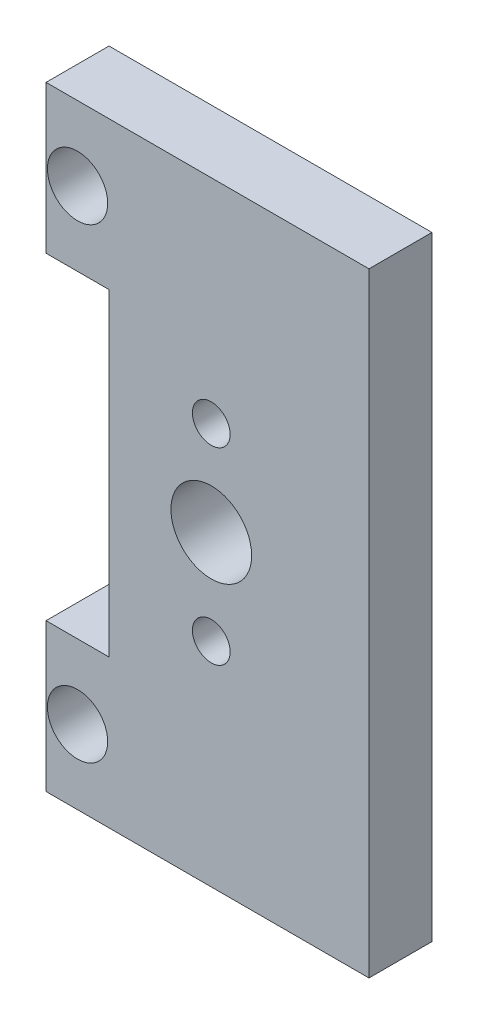
ISO-10303-21;
HEADER;
FILE_DESCRIPTION(('STEP AP214'),'2;1');
FILE_NAME('part.step','',(''),(''),'','','');
FILE_SCHEMA(('AUTOMOTIVE_DESIGN { 1 0 10303 214 1 1 1 1 }'));
ENDSEC;
DATA;
#1=APPLICATION_CONTEXT('core data for automotive mechanical design processes');
#2=APPLICATION_PROTOCOL_DEFINITION('international standard','automotive_design',2000,#1);
#3=PRODUCT_CONTEXT('',#1,'mechanical');
#4=PRODUCT('Part','Part','',(#3));
#5=PRODUCT_RELATED_PRODUCT_CATEGORY('part','',(#4));
#6=PRODUCT_DEFINITION_FORMATION('','',#4);
#7=PRODUCT_DEFINITION_CONTEXT('part definition',#1,'design');
#8=PRODUCT_DEFINITION('design','',#6,#7);
#9=PRODUCT_DEFINITION_SHAPE('','',#8);
#10=(LENGTH_UNIT() NAMED_UNIT(*) SI_UNIT(.MILLI.,.METRE.));
#11=(NAMED_UNIT(*) PLANE_ANGLE_UNIT() SI_UNIT($,.RADIAN.));
#12=(NAMED_UNIT(*) SI_UNIT($,.STERADIAN.) SOLID_ANGLE_UNIT());
#13=UNCERTAINTY_MEASURE_WITH_UNIT(LENGTH_MEASURE(1.E-05),#10,'distance_accuracy_value','');
#14=(GEOMETRIC_REPRESENTATION_CONTEXT(3) GLOBAL_UNCERTAINTY_ASSIGNED_CONTEXT((#13)) GLOBAL_UNIT_ASSIGNED_CONTEXT((#10,
#11,#12)) REPRESENTATION_CONTEXT('',''));
#15=CARTESIAN_POINT('',(0.,0.,0.));
#16=DIRECTION('',(0.,0.,1.));
#17=DIRECTION('',(1.,0.,0.));
#18=AXIS2_PLACEMENT_3D('',#15,#16,#17);
#19=CARTESIAN_POINT('',(0.,0.,2.9718));
#20=DIRECTION('',(0.,1.,0.));
#21=DIRECTION('',(0.,0.,1.));
#22=AXIS2_PLACEMENT_3D('',#19,#20,#21);
#23=PLANE('',#22);
#24=DIRECTION('',(1.,0.,0.));
#25=VECTOR('',#24,1.);
#26=CARTESIAN_POINT('',(0.,0.,0.));
#27=LINE('',#26,#25);
#28=CARTESIAN_POINT('',(0.,0.,0.));
#29=VERTEX_POINT('',#28);
#30=CARTESIAN_POINT('',(15.24,0.,0.));
#31=VERTEX_POINT('',#30);
#32=EDGE_CURVE('E152',#29,#31,#27,.T.);
#33=ORIENTED_EDGE('',*,*,#32,.T.);
#34=DIRECTION('',(0.,0.,-1.));
#35=VECTOR('',#34,1.);
#36=CARTESIAN_POINT('',(15.24,0.,2.9718));
#37=LINE('',#36,#35);
#38=CARTESIAN_POINT('',(15.24,0.,2.9718));
#39=VERTEX_POINT('',#38);
#40=EDGE_CURVE('E11',#39,#31,#37,.T.);
#41=ORIENTED_EDGE('',*,*,#40,.F.);
#42=DIRECTION('',(1.,0.,0.));
#43=VECTOR('',#42,1.);
#44=CARTESIAN_POINT('',(0.,0.,2.9718));
#45=LINE('',#44,#43);
#46=CARTESIAN_POINT('',(0.,0.,2.9718));
#47=VERTEX_POINT('',#46);
#48=EDGE_CURVE('E210',#47,#39,#45,.T.);
#49=ORIENTED_EDGE('',*,*,#48,.F.);
#50=DIRECTION('',(0.,0.,-1.));
#51=VECTOR('',#50,1.);
#52=CARTESIAN_POINT('',(0.,0.,2.9718));
#53=LINE('',#52,#51);
#54=EDGE_CURVE('E55',#47,#29,#53,.T.);
#55=ORIENTED_EDGE('',*,*,#54,.T.);
#56=EDGE_LOOP('',(#33,#41,#49,#55));
#57=FACE_BOUND('',#56,.T.);
#58=ADVANCED_FACE('F38',(#57),#23,.F.);
#59=CARTESIAN_POINT('',(15.24,0.,2.9718));
#60=DIRECTION('',(-1.,0.,0.));
#61=DIRECTION('',(0.,-1.,0.));
#62=AXIS2_PLACEMENT_3D('',#59,#60,#61);
#63=PLANE('',#62);
#64=DIRECTION('',(0.,1.,0.));
#65=VECTOR('',#64,1.);
#66=CARTESIAN_POINT('',(15.24,0.,0.));
#67=LINE('',#66,#65);
#68=CARTESIAN_POINT('',(15.24,28.985,0.));
#69=VERTEX_POINT('',#68);
#70=EDGE_CURVE('E154',#31,#69,#67,.T.);
#71=ORIENTED_EDGE('',*,*,#70,.T.);
#72=DIRECTION('',(0.,0.,-1.));
#73=VECTOR('',#72,1.);
#74=CARTESIAN_POINT('',(15.24,28.985,2.9718));
#75=LINE('',#74,#73);
#76=CARTESIAN_POINT('',(15.24,28.985,2.9718));
#77=VERTEX_POINT('',#76);
#78=EDGE_CURVE('E47',#77,#69,#75,.T.);
#79=ORIENTED_EDGE('',*,*,#78,.F.);
#80=DIRECTION('',(0.,1.,0.));
#81=VECTOR('',#80,1.);
#82=CARTESIAN_POINT('',(15.24,0.,2.9718));
#83=LINE('',#82,#81);
#84=EDGE_CURVE('E93',#39,#77,#83,.T.);
#85=ORIENTED_EDGE('',*,*,#84,.F.);
#86=ORIENTED_EDGE('',*,*,#40,.T.);
#87=EDGE_LOOP('',(#71,#79,#85,#86));
#88=FACE_BOUND('',#87,.T.);
#89=ADVANCED_FACE('F197',(#88),#63,.F.);
#90=CARTESIAN_POINT('',(0.,28.985,2.9718));
#91=DIRECTION('',(0.,1.,0.));
#92=DIRECTION('',(-1.,0.,0.));
#93=AXIS2_PLACEMENT_3D('',#90,#91,#92);
#94=PLANE('',#93);
#95=DIRECTION('',(1.,0.,0.));
#96=VECTOR('',#95,1.);
#97=CARTESIAN_POINT('',(0.,28.985,0.));
#98=LINE('',#97,#96);
#99=CARTESIAN_POINT('',(0.,28.985,0.));
#100=VERTEX_POINT('',#99);
#101=EDGE_CURVE('E157',#100,#69,#98,.T.);
#102=ORIENTED_EDGE('',*,*,#101,.F.);
#103=DIRECTION('',(0.,0.,-1.));
#104=VECTOR('',#103,1.);
#105=CARTESIAN_POINT('',(0.,28.985,2.9718));
#106=LINE('',#105,#104);
#107=CARTESIAN_POINT('',(0.,28.985,2.9718));
#108=VERTEX_POINT('',#107);
#109=EDGE_CURVE('E190',#108,#100,#106,.T.);
#110=ORIENTED_EDGE('',*,*,#109,.F.);
#111=DIRECTION('',(1.,0.,0.));
#112=VECTOR('',#111,1.);
#113=CARTESIAN_POINT('',(0.,28.985,2.9718));
#114=LINE('',#113,#112);
#115=EDGE_CURVE('E196',#108,#77,#114,.T.);
#116=ORIENTED_EDGE('',*,*,#115,.T.);
#117=ORIENTED_EDGE('',*,*,#78,.T.);
#118=EDGE_LOOP('',(#102,#110,#116,#117));
#119=FACE_BOUND('',#118,.T.);
#120=ADVANCED_FACE('F194',(#119),#94,.T.);
#121=CARTESIAN_POINT('',(0.,0.,2.9718));
#122=DIRECTION('',(-1.,0.,0.));
#123=DIRECTION('',(0.,0.,1.));
#124=AXIS2_PLACEMENT_3D('',#121,#122,#123);
#125=PLANE('',#124);
#126=DIRECTION('',(0.,1.,0.));
#127=VECTOR('',#126,1.);
#128=CARTESIAN_POINT('',(0.,0.,0.));
#129=LINE('',#128,#127);
#130=CARTESIAN_POINT('',(0.,22.,0.));
#131=VERTEX_POINT('',#130);
#132=EDGE_CURVE('E160',#131,#100,#129,.T.);
#133=ORIENTED_EDGE('',*,*,#132,.F.);
#134=DIRECTION('',(0.,0.,-1.));
#135=VECTOR('',#134,1.);
#136=CARTESIAN_POINT('',(0.,22.,2.9718));
#137=LINE('',#136,#135);
#138=CARTESIAN_POINT('',(0.,22.,2.9718));
#139=VERTEX_POINT('',#138);
#140=EDGE_CURVE('E188',#139,#131,#137,.T.);
#141=ORIENTED_EDGE('',*,*,#140,.F.);
#142=DIRECTION('',(0.,1.,0.));
#143=VECTOR('',#142,1.);
#144=CARTESIAN_POINT('',(0.,0.,2.9718));
#145=LINE('',#144,#143);
#146=EDGE_CURVE('E207',#139,#108,#145,.T.);
#147=ORIENTED_EDGE('',*,*,#146,.T.);
#148=ORIENTED_EDGE('',*,*,#109,.T.);
#149=EDGE_LOOP('',(#133,#141,#147,#148));
#150=FACE_BOUND('',#149,.T.);
#151=ADVANCED_FACE('F205',(#150),#125,.T.);
#152=CARTESIAN_POINT('',(0.,22.,2.9718));
#153=DIRECTION('',(0.,1.,0.));
#154=DIRECTION('',(0.,0.,1.));
#155=AXIS2_PLACEMENT_3D('',#152,#153,#154);
#156=PLANE('',#155);
#157=DIRECTION('',(1.,0.,0.));
#158=VECTOR('',#157,1.);
#159=CARTESIAN_POINT('',(0.,22.,0.));
#160=LINE('',#159,#158);
#161=CARTESIAN_POINT('',(2.9718,22.,0.));
#162=VERTEX_POINT('',#161);
#163=EDGE_CURVE('E163',#131,#162,#160,.T.);
#164=ORIENTED_EDGE('',*,*,#163,.T.);
#165=DIRECTION('',(0.,0.,-1.));
#166=VECTOR('',#165,1.);
#167=CARTESIAN_POINT('',(2.9718,22.,2.9718));
#168=LINE('',#167,#166);
#169=CARTESIAN_POINT('',(2.9718,22.,2.9718));
#170=VERTEX_POINT('',#169);
#171=EDGE_CURVE('E118',#170,#162,#168,.T.);
#172=ORIENTED_EDGE('',*,*,#171,.F.);
#173=DIRECTION('',(1.,0.,0.));
#174=VECTOR('',#173,1.);
#175=CARTESIAN_POINT('',(0.,22.,2.9718));
#176=LINE('',#175,#174);
#177=EDGE_CURVE('E128',#139,#170,#176,.T.);
#178=ORIENTED_EDGE('',*,*,#177,.F.);
#179=ORIENTED_EDGE('',*,*,#140,.T.);
#180=EDGE_LOOP('',(#164,#172,#178,#179));
#181=FACE_BOUND('',#180,.T.);
#182=ADVANCED_FACE('F240',(#181),#156,.F.);
#183=CARTESIAN_POINT('',(2.9718,0.,2.9718));
#184=DIRECTION('',(-1.,0.,0.));
#185=DIRECTION('',(0.,-1.,0.));
#186=AXIS2_PLACEMENT_3D('',#183,#184,#185);
#187=PLANE('',#186);
#188=DIRECTION('',(0.,1.,0.));
#189=VECTOR('',#188,1.);
#190=CARTESIAN_POINT('',(2.9718,0.,0.));
#191=LINE('',#190,#189);
#192=CARTESIAN_POINT('',(2.9718,6.985,0.));
#193=VERTEX_POINT('',#192);
#194=EDGE_CURVE('E114',#193,#162,#191,.T.);
#195=ORIENTED_EDGE('',*,*,#194,.F.);
#196=DIRECTION('',(0.,0.,-1.));
#197=VECTOR('',#196,1.);
#198=CARTESIAN_POINT('',(2.9718,6.985,2.9718));
#199=LINE('',#198,#197);
#200=CARTESIAN_POINT('',(2.9718,6.985,2.9718));
#201=VERTEX_POINT('',#200);
#202=EDGE_CURVE('E109',#201,#193,#199,.T.);
#203=ORIENTED_EDGE('',*,*,#202,.F.);
#204=DIRECTION('',(0.,1.,0.));
#205=VECTOR('',#204,1.);
#206=CARTESIAN_POINT('',(2.9718,0.,2.9718));
#207=LINE('',#206,#205);
#208=EDGE_CURVE('E112',#201,#170,#207,.T.);
#209=ORIENTED_EDGE('',*,*,#208,.T.);
#210=ORIENTED_EDGE('',*,*,#171,.T.);
#211=EDGE_LOOP('',(#195,#203,#209,#210));
#212=FACE_BOUND('',#211,.T.);
#213=ADVANCED_FACE('F111',(#212),#187,.T.);
#214=CARTESIAN_POINT('',(0.,6.985,2.9718));
#215=DIRECTION('',(0.,1.,0.));
#216=DIRECTION('',(0.,0.,1.));
#217=AXIS2_PLACEMENT_3D('',#214,#215,#216);
#218=PLANE('',#217);
#219=DIRECTION('',(1.,0.,0.));
#220=VECTOR('',#219,1.);
#221=CARTESIAN_POINT('',(0.,6.985,0.));
#222=LINE('',#221,#220);
#223=CARTESIAN_POINT('',(0.,6.985,0.));
#224=VERTEX_POINT('',#223);
#225=EDGE_CURVE('E167',#224,#193,#222,.T.);
#226=ORIENTED_EDGE('',*,*,#225,.F.);
#227=DIRECTION('',(0.,0.,-1.));
#228=VECTOR('',#227,1.);
#229=CARTESIAN_POINT('',(0.,6.985,2.9718));
#230=LINE('',#229,#228);
#231=CARTESIAN_POINT('',(0.,6.985,2.9718));
#232=VERTEX_POINT('',#231);
#233=EDGE_CURVE('E81',#232,#224,#230,.T.);
#234=ORIENTED_EDGE('',*,*,#233,.F.);
#235=DIRECTION('',(1.,0.,0.));
#236=VECTOR('',#235,1.);
#237=CARTESIAN_POINT('',(0.,6.985,2.9718));
#238=LINE('',#237,#236);
#239=EDGE_CURVE('E125',#232,#201,#238,.T.);
#240=ORIENTED_EDGE('',*,*,#239,.T.);
#241=ORIENTED_EDGE('',*,*,#202,.T.);
#242=EDGE_LOOP('',(#226,#234,#240,#241));
#243=FACE_BOUND('',#242,.T.);
#244=ADVANCED_FACE('F131',(#243),#218,.T.);
#245=CARTESIAN_POINT('',(7.7978,10.0475,2.9718));
#246=DIRECTION('',(0.,0.,-1.));
#247=DIRECTION('',(-1.,0.,0.));
#248=AXIS2_PLACEMENT_3D('',#245,#246,#247);
#249=CYLINDRICAL_SURFACE('',#248,0.889000000000003);
#250=CARTESIAN_POINT('',(7.7978,10.0475,2.9718));
#251=DIRECTION('',(0.,0.,1.));
#252=DIRECTION('',(1.,0.,0.));
#253=AXIS2_PLACEMENT_3D('',#250,#251,#252);
#254=CIRCLE('',#253,0.889000000000003);
#255=CARTESIAN_POINT('',(8.6868,10.0475,2.9718));
#256=VERTEX_POINT('',#255);
#257=EDGE_CURVE('E143',#256,#256,#254,.T.);
#258=ORIENTED_EDGE('',*,*,#257,.T.);
#259=EDGE_LOOP('',(#258));
#260=FACE_BOUND('',#259,.T.);
#261=CARTESIAN_POINT('',(7.7978,10.0475,0.));
#262=DIRECTION('',(0.,0.,1.));
#263=DIRECTION('',(1.,0.,0.));
#264=AXIS2_PLACEMENT_3D('',#261,#262,#263);
#265=CIRCLE('',#264,0.889000000000003);
#266=CARTESIAN_POINT('',(8.6868,10.0475,0.));
#267=VERTEX_POINT('',#266);
#268=EDGE_CURVE('E178',#267,#267,#265,.T.);
#269=ORIENTED_EDGE('',*,*,#268,.F.);
#270=EDGE_LOOP('',(#269));
#271=FACE_BOUND('',#270,.T.);
#272=ADVANCED_FACE('F248',(#260,#271),#249,.F.);
#273=CARTESIAN_POINT('',(7.7978,18.9375,2.9718));
#274=DIRECTION('',(0.,0.,-1.));
#275=DIRECTION('',(-1.,0.,0.));
#276=AXIS2_PLACEMENT_3D('',#273,#274,#275);
#277=CYLINDRICAL_SURFACE('',#276,0.889000000000003);
#278=CARTESIAN_POINT('',(7.7978,18.9375,2.9718));
#279=DIRECTION('',(0.,0.,1.));
#280=DIRECTION('',(1.,0.,0.));
#281=AXIS2_PLACEMENT_3D('',#278,#279,#280);
#282=CIRCLE('',#281,0.889000000000003);
#283=CARTESIAN_POINT('',(8.6868,18.9375,2.9718));
#284=VERTEX_POINT('',#283);
#285=EDGE_CURVE('E140',#284,#284,#282,.F.);
#286=ORIENTED_EDGE('',*,*,#285,.F.);
#287=EDGE_LOOP('',(#286));
#288=FACE_BOUND('',#287,.T.);
#289=CARTESIAN_POINT('',(7.7978,18.9375,0.));
#290=DIRECTION('',(0.,0.,1.));
#291=DIRECTION('',(1.,0.,0.));
#292=AXIS2_PLACEMENT_3D('',#289,#290,#291);
#293=CIRCLE('',#292,0.889000000000003);
#294=CARTESIAN_POINT('',(8.6868,18.9375,0.));
#295=VERTEX_POINT('',#294);
#296=EDGE_CURVE('E175',#295,#295,#293,.F.);
#297=ORIENTED_EDGE('',*,*,#296,.T.);
#298=EDGE_LOOP('',(#297));
#299=FACE_BOUND('',#298,.T.);
#300=ADVANCED_FACE('F255',(#288,#299),#277,.F.);
#301=CARTESIAN_POINT('',(1.4859,25.4925,2.9718));
#302=DIRECTION('',(0.,0.,-1.));
#303=DIRECTION('',(-1.,0.,0.));
#304=AXIS2_PLACEMENT_3D('',#301,#302,#303);
#305=CYLINDRICAL_SURFACE('',#304,1.4224);
#306=CARTESIAN_POINT('',(1.4859,25.4925,2.9718));
#307=DIRECTION('',(0.,0.,1.));
#308=DIRECTION('',(1.,0.,0.));
#309=AXIS2_PLACEMENT_3D('',#306,#307,#308);
#310=CIRCLE('',#309,1.4224);
#311=CARTESIAN_POINT('',(2.9083,25.4925,2.9718));
#312=VERTEX_POINT('',#311);
#313=EDGE_CURVE('E134',#312,#312,#310,.T.);
#314=ORIENTED_EDGE('',*,*,#313,.T.);
#315=EDGE_LOOP('',(#314));
#316=FACE_BOUND('',#315,.T.);
#317=CARTESIAN_POINT('',(1.4859,25.4925,0.));
#318=DIRECTION('',(0.,0.,1.));
#319=DIRECTION('',(1.,0.,0.));
#320=AXIS2_PLACEMENT_3D('',#317,#318,#319);
#321=CIRCLE('',#320,1.4224);
#322=CARTESIAN_POINT('',(2.9083,25.4925,0.));
#323=VERTEX_POINT('',#322);
#324=EDGE_CURVE('E172',#323,#323,#321,.T.);
#325=ORIENTED_EDGE('',*,*,#324,.F.);
#326=EDGE_LOOP('',(#325));
#327=FACE_BOUND('',#326,.T.);
#328=ADVANCED_FACE('F252',(#316,#327),#305,.F.);
#329=CARTESIAN_POINT('',(0.,0.,2.9718));
#330=DIRECTION('',(-1.,0.,0.));
#331=DIRECTION('',(0.,0.,1.));
#332=AXIS2_PLACEMENT_3D('',#329,#330,#331);
#333=PLANE('',#332);
#334=DIRECTION('',(0.,1.,0.));
#335=VECTOR('',#334,1.);
#336=CARTESIAN_POINT('',(0.,0.,0.));
#337=LINE('',#336,#335);
#338=EDGE_CURVE('E169',#29,#224,#337,.T.);
#339=ORIENTED_EDGE('',*,*,#338,.F.);
#340=ORIENTED_EDGE('',*,*,#54,.F.);
#341=DIRECTION('',(0.,1.,0.));
#342=VECTOR('',#341,1.);
#343=CARTESIAN_POINT('',(0.,0.,2.9718));
#344=LINE('',#343,#342);
#345=EDGE_CURVE('E132',#47,#232,#344,.T.);
#346=ORIENTED_EDGE('',*,*,#345,.T.);
#347=ORIENTED_EDGE('',*,*,#233,.T.);
#348=EDGE_LOOP('',(#339,#340,#346,#347));
#349=FACE_BOUND('',#348,.T.);
#350=ADVANCED_FACE('F249',(#349),#333,.T.);
#351=CARTESIAN_POINT('',(7.7978,14.4925,2.9718));
#352=DIRECTION('',(0.,0.,-1.));
#353=DIRECTION('',(-1.,0.,0.));
#354=AXIS2_PLACEMENT_3D('',#351,#352,#353);
#355=CYLINDRICAL_SURFACE('',#354,1.905);
#356=CARTESIAN_POINT('',(7.7978,14.4925,2.9718));
#357=DIRECTION('',(0.,0.,1.));
#358=DIRECTION('',(1.,0.,0.));
#359=AXIS2_PLACEMENT_3D('',#356,#357,#358);
#360=CIRCLE('',#359,1.905);
#361=CARTESIAN_POINT('',(9.7028,14.4925,2.9718));
#362=VERTEX_POINT('',#361);
#363=EDGE_CURVE('E184',#362,#362,#360,.T.);
#364=ORIENTED_EDGE('',*,*,#363,.T.);
#365=EDGE_LOOP('',(#364));
#366=FACE_BOUND('',#365,.T.);
#367=CARTESIAN_POINT('',(7.7978,14.4925,0.));
#368=DIRECTION('',(0.,0.,1.));
#369=DIRECTION('',(1.,0.,0.));
#370=AXIS2_PLACEMENT_3D('',#367,#368,#369);
#371=CIRCLE('',#370,1.905);
#372=CARTESIAN_POINT('',(9.7028,14.4925,0.));
#373=VERTEX_POINT('',#372);
#374=EDGE_CURVE('E149',#373,#373,#371,.T.);
#375=ORIENTED_EDGE('',*,*,#374,.F.);
#376=EDGE_LOOP('',(#375));
#377=FACE_BOUND('',#376,.T.);
#378=ADVANCED_FACE('F40',(#366,#377),#355,.F.);
#379=CARTESIAN_POINT('',(1.4859,3.4925,2.9718));
#380=DIRECTION('',(0.,0.,-1.));
#381=DIRECTION('',(-1.,0.,0.));
#382=AXIS2_PLACEMENT_3D('',#379,#380,#381);
#383=CYLINDRICAL_SURFACE('',#382,1.4224);
#384=CARTESIAN_POINT('',(1.4859,3.4925,2.9718));
#385=DIRECTION('',(0.,0.,1.));
#386=DIRECTION('',(1.,0.,0.));
#387=AXIS2_PLACEMENT_3D('',#384,#385,#386);
#388=CIRCLE('',#387,1.4224);
#389=CARTESIAN_POINT('',(2.9083,3.4925,2.9718));
#390=VERTEX_POINT('',#389);
#391=EDGE_CURVE('E146',#390,#390,#388,.F.);
#392=ORIENTED_EDGE('',*,*,#391,.F.);
#393=EDGE_LOOP('',(#392));
#394=FACE_BOUND('',#393,.T.);
#395=CARTESIAN_POINT('',(1.4859,3.4925,0.));
#396=DIRECTION('',(0.,0.,1.));
#397=DIRECTION('',(1.,0.,0.));
#398=AXIS2_PLACEMENT_3D('',#395,#396,#397);
#399=CIRCLE('',#398,1.4224);
#400=CARTESIAN_POINT('',(2.9083,3.4925,0.));
#401=VERTEX_POINT('',#400);
#402=EDGE_CURVE('E181',#401,#401,#399,.F.);
#403=ORIENTED_EDGE('',*,*,#402,.T.);
#404=EDGE_LOOP('',(#403));
#405=FACE_BOUND('',#404,.T.);
#406=ADVANCED_FACE('F220',(#394,#405),#383,.F.);
#407=CARTESIAN_POINT('',(0.,0.,2.9718));
#408=DIRECTION('',(0.,0.,1.));
#409=DIRECTION('',(1.,0.,0.));
#410=AXIS2_PLACEMENT_3D('',#407,#408,#409);
#411=PLANE('',#410);
#412=ORIENTED_EDGE('',*,*,#363,.F.);
#413=EDGE_LOOP('',(#412));
#414=FACE_BOUND('',#413,.T.);
#415=ORIENTED_EDGE('',*,*,#48,.T.);
#416=ORIENTED_EDGE('',*,*,#84,.T.);
#417=ORIENTED_EDGE('',*,*,#115,.F.);
#418=ORIENTED_EDGE('',*,*,#146,.F.);
#419=ORIENTED_EDGE('',*,*,#177,.T.);
#420=ORIENTED_EDGE('',*,*,#208,.F.);
#421=ORIENTED_EDGE('',*,*,#239,.F.);
#422=ORIENTED_EDGE('',*,*,#345,.F.);
#423=EDGE_LOOP('',(#415,#416,#417,#418,#419,#420,#421,#422));
#424=FACE_BOUND('',#423,.T.);
#425=ORIENTED_EDGE('',*,*,#313,.F.);
#426=EDGE_LOOP('',(#425));
#427=FACE_BOUND('',#426,.T.);
#428=ORIENTED_EDGE('',*,*,#285,.T.);
#429=EDGE_LOOP('',(#428));
#430=FACE_BOUND('',#429,.T.);
#431=ORIENTED_EDGE('',*,*,#257,.F.);
#432=EDGE_LOOP('',(#431));
#433=FACE_BOUND('',#432,.T.);
#434=ORIENTED_EDGE('',*,*,#391,.T.);
#435=EDGE_LOOP('',(#434));
#436=FACE_BOUND('',#435,.T.);
#437=ADVANCED_FACE('F122',(#414,#424,#427,#430,#433,#436),#411,.T.);
#438=CARTESIAN_POINT('',(0.,0.,0.));
#439=DIRECTION('',(0.,0.,1.));
#440=DIRECTION('',(1.,0.,0.));
#441=AXIS2_PLACEMENT_3D('',#438,#439,#440);
#442=PLANE('',#441);
#443=ORIENTED_EDGE('',*,*,#374,.T.);
#444=EDGE_LOOP('',(#443));
#445=FACE_BOUND('',#444,.T.);
#446=ORIENTED_EDGE('',*,*,#32,.F.);
#447=ORIENTED_EDGE('',*,*,#338,.T.);
#448=ORIENTED_EDGE('',*,*,#225,.T.);
#449=ORIENTED_EDGE('',*,*,#194,.T.);
#450=ORIENTED_EDGE('',*,*,#163,.F.);
#451=ORIENTED_EDGE('',*,*,#132,.T.);
#452=ORIENTED_EDGE('',*,*,#101,.T.);
#453=ORIENTED_EDGE('',*,*,#70,.F.);
#454=EDGE_LOOP('',(#446,#447,#448,#449,#450,#451,#452,#453));
#455=FACE_BOUND('',#454,.T.);
#456=ORIENTED_EDGE('',*,*,#324,.T.);
#457=EDGE_LOOP('',(#456));
#458=FACE_BOUND('',#457,.T.);
#459=ORIENTED_EDGE('',*,*,#296,.F.);
#460=EDGE_LOOP('',(#459));
#461=FACE_BOUND('',#460,.T.);
#462=ORIENTED_EDGE('',*,*,#268,.T.);
#463=EDGE_LOOP('',(#462));
#464=FACE_BOUND('',#463,.T.);
#465=ORIENTED_EDGE('',*,*,#402,.F.);
#466=EDGE_LOOP('',(#465));
#467=FACE_BOUND('',#466,.T.);
#468=ADVANCED_FACE('F200',(#445,#455,#458,#461,#464,#467),#442,.F.);
#469=CLOSED_SHELL('',(#58,#89,#120,#151,#182,#213,#244,#272,#300,#328,#350,#378,#406,#437,#468));
#470=MANIFOLD_SOLID_BREP('B2',#469);
#471=ADVANCED_BREP_SHAPE_REPRESENTATION('',(#18,#470),#14);
#472=SHAPE_DEFINITION_REPRESENTATION(#9,#471);
ENDSEC;
END-ISO-10303-21;
